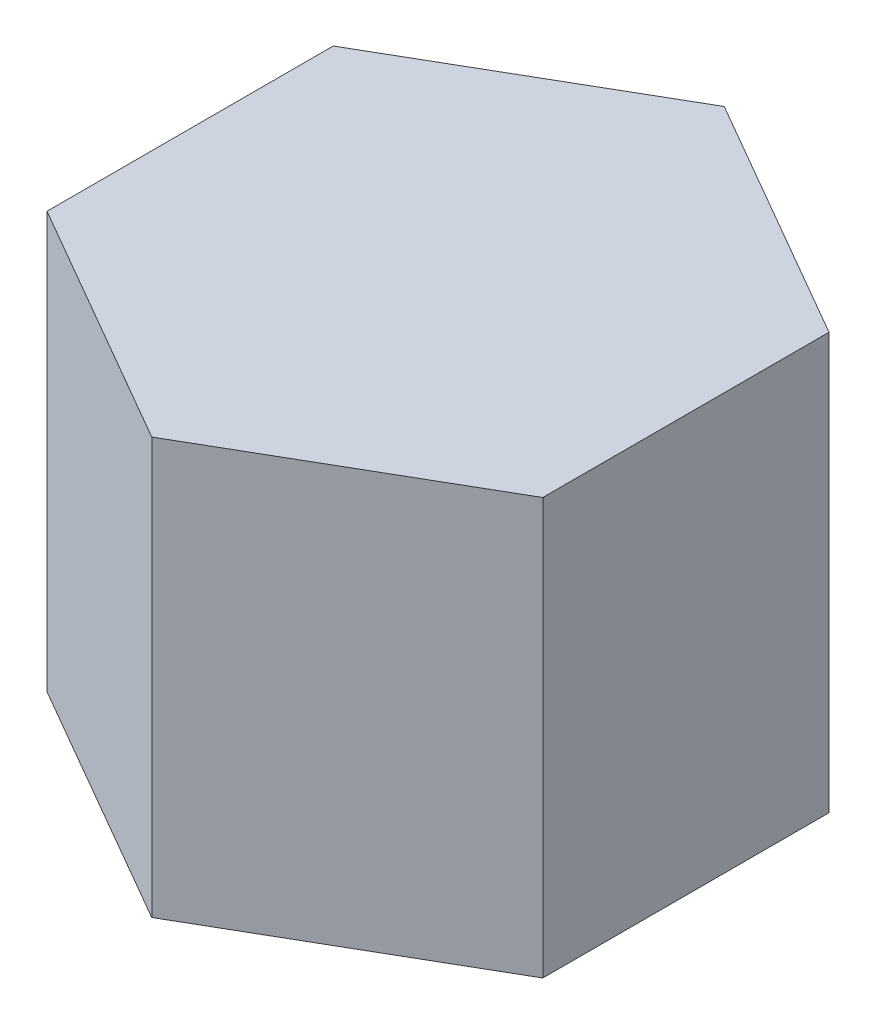
ISO-10303-21;
HEADER;
FILE_DESCRIPTION(('STEP AP214'),'2;1');
FILE_NAME('part.step','',(''),(''),'','','');
FILE_SCHEMA(('AUTOMOTIVE_DESIGN { 1 0 10303 214 1 1 1 1 }'));
ENDSEC;
DATA;
#1=APPLICATION_CONTEXT('core data for automotive mechanical design processes');
#2=APPLICATION_PROTOCOL_DEFINITION('international standard','automotive_design',2000,#1);
#3=PRODUCT_CONTEXT('',#1,'mechanical');
#4=PRODUCT('Part','Part','',(#3));
#5=PRODUCT_RELATED_PRODUCT_CATEGORY('part','',(#4));
#6=PRODUCT_DEFINITION_FORMATION('','',#4);
#7=PRODUCT_DEFINITION_CONTEXT('part definition',#1,'design');
#8=PRODUCT_DEFINITION('design','',#6,#7);
#9=PRODUCT_DEFINITION_SHAPE('','',#8);
#10=(LENGTH_UNIT() NAMED_UNIT(*) SI_UNIT(.MILLI.,.METRE.));
#11=(NAMED_UNIT(*) PLANE_ANGLE_UNIT() SI_UNIT($,.RADIAN.));
#12=(NAMED_UNIT(*) SI_UNIT($,.STERADIAN.) SOLID_ANGLE_UNIT());
#13=UNCERTAINTY_MEASURE_WITH_UNIT(LENGTH_MEASURE(1.E-05),#10,'distance_accuracy_value','');
#14=(GEOMETRIC_REPRESENTATION_CONTEXT(3) GLOBAL_UNCERTAINTY_ASSIGNED_CONTEXT((#13)) GLOBAL_UNIT_ASSIGNED_CONTEXT((#10,
#11,#12)) REPRESENTATION_CONTEXT('',''));
#15=CARTESIAN_POINT('',(0.,0.,0.));
#16=DIRECTION('',(0.,0.,1.));
#17=DIRECTION('',(1.,0.,0.));
#18=AXIS2_PLACEMENT_3D('',#15,#16,#17);
#19=CARTESIAN_POINT('',(201.839551417382,-147.556598747966,290.81594581671));
#20=DIRECTION('',(-0.500000000000096,0.,-0.866025403784383));
#21=DIRECTION('',(-0.866025403784383,0.,0.500000000000096));
#22=AXIS2_PLACEMENT_3D('',#19,#20,#21);
#23=PLANE('',#22);
#24=CARTESIAN_POINT('',(202.142660308706,-147.047793579175,290.64094581671));
#25=DIRECTION('',(-0.866025403784383,0.,0.500000000000096));
#26=VECTOR('',#25,1.);
#27=LINE('',#24,#26);
#28=CARTESIAN_POINT('',(202.142660308706,-147.047793579175,290.64094581671));
#29=VERTEX_POINT('',#28);
#30=CARTESIAN_POINT('',(201.839551417382,-147.047793579175,290.81594581671));
#31=VERTEX_POINT('',#30);
#32=EDGE_CURVE('E170',#29,#31,#27,.T.);
#33=ORIENTED_EDGE('',*,*,#32,.T.);
#34=CARTESIAN_POINT('',(201.839551417382,-147.556598747966,290.81594581671));
#35=DIRECTION('',(0.,1.,0.));
#36=VECTOR('',#35,1.);
#37=LINE('',#34,#36);
#38=CARTESIAN_POINT('',(201.839551417382,-147.556598747966,290.81594581671));
#39=VERTEX_POINT('',#38);
#40=EDGE_CURVE('E35',#39,#31,#37,.T.);
#41=ORIENTED_EDGE('',*,*,#40,.F.);
#42=CARTESIAN_POINT('',(202.142660308706,-147.556598747966,290.64094581671));
#43=DIRECTION('',(-0.866025403784383,0.,0.500000000000096));
#44=VECTOR('',#43,1.);
#45=LINE('',#42,#44);
#46=CARTESIAN_POINT('',(202.142660308706,-147.556598747966,290.64094581671));
#47=VERTEX_POINT('',#46);
#48=EDGE_CURVE('E159',#47,#39,#45,.T.);
#49=ORIENTED_EDGE('',*,*,#48,.F.);
#50=CARTESIAN_POINT('',(202.142660308706,-147.556598747966,290.64094581671));
#51=DIRECTION('',(0.,1.,0.));
#52=VECTOR('',#51,1.);
#53=LINE('',#50,#52);
#54=EDGE_CURVE('E10',#47,#29,#53,.T.);
#55=ORIENTED_EDGE('',*,*,#54,.T.);
#56=EDGE_LOOP('',(#33,#41,#49,#55));
#57=FACE_BOUND('',#56,.T.);
#58=ADVANCED_FACE('F16',(#57),#23,.F.);
#59=CARTESIAN_POINT('',(202.142660308706,-147.556598747966,291.594471220494));
#60=DIRECTION('',(-1.,0.,0.));
#61=DIRECTION('',(0.,-1.,0.));
#62=AXIS2_PLACEMENT_3D('',#59,#60,#61);
#63=PLANE('',#62);
#64=CARTESIAN_POINT('',(202.142660308706,-147.047793579175,290.29094581671));
#65=DIRECTION('',(0.,0.,1.));
#66=VECTOR('',#65,1.);
#67=LINE('',#64,#66);
#68=CARTESIAN_POINT('',(202.142660308706,-147.047793579175,290.29094581671));
#69=VERTEX_POINT('',#68);
#70=EDGE_CURVE('E167',#69,#29,#67,.T.);
#71=ORIENTED_EDGE('',*,*,#70,.T.);
#72=ORIENTED_EDGE('',*,*,#54,.F.);
#73=CARTESIAN_POINT('',(202.142660308706,-147.556598747966,290.29094581671));
#74=DIRECTION('',(0.,0.,1.));
#75=VECTOR('',#74,1.);
#76=LINE('',#73,#75);
#77=CARTESIAN_POINT('',(202.142660308706,-147.556598747966,290.29094581671));
#78=VERTEX_POINT('',#77);
#79=EDGE_CURVE('E156',#78,#47,#76,.T.);
#80=ORIENTED_EDGE('',*,*,#79,.F.);
#81=CARTESIAN_POINT('',(202.142660308706,-147.556598747966,290.29094581671));
#82=DIRECTION('',(0.,1.,0.));
#83=VECTOR('',#82,1.);
#84=LINE('',#81,#83);
#85=EDGE_CURVE('E27',#78,#69,#84,.T.);
#86=ORIENTED_EDGE('',*,*,#85,.T.);
#87=EDGE_LOOP('',(#71,#72,#80,#86));
#88=FACE_BOUND('',#87,.T.);
#89=ADVANCED_FACE('F189',(#88),#63,.F.);
#90=CARTESIAN_POINT('',(202.142660308706,-147.556598747966,290.29094581671));
#91=DIRECTION('',(-0.499999999999909,0.,0.866025403784491));
#92=DIRECTION('',(0.866025403784491,0.,0.499999999999909));
#93=AXIS2_PLACEMENT_3D('',#90,#91,#92);
#94=PLANE('',#93);
#95=CARTESIAN_POINT('',(201.839551417381,-147.047793579175,290.11594581671));
#96=DIRECTION('',(0.866025403784491,0.,0.499999999999909));
#97=VECTOR('',#96,1.);
#98=LINE('',#95,#97);
#99=CARTESIAN_POINT('',(201.839551417382,-147.047793579175,290.11594581671));
#100=VERTEX_POINT('',#99);
#101=EDGE_CURVE('E163',#100,#69,#98,.T.);
#102=ORIENTED_EDGE('',*,*,#101,.T.);
#103=ORIENTED_EDGE('',*,*,#85,.F.);
#104=CARTESIAN_POINT('',(201.839551417381,-147.556598747966,290.11594581671));
#105=DIRECTION('',(0.866025403784491,0.,0.499999999999909));
#106=VECTOR('',#105,1.);
#107=LINE('',#104,#106);
#108=CARTESIAN_POINT('',(201.839551417382,-147.556598747966,290.11594581671));
#109=VERTEX_POINT('',#108);
#110=EDGE_CURVE('E106',#109,#78,#107,.T.);
#111=ORIENTED_EDGE('',*,*,#110,.F.);
#112=CARTESIAN_POINT('',(201.839551417381,-147.556598747966,290.11594581671));
#113=DIRECTION('',(0.,1.,0.));
#114=VECTOR('',#113,1.);
#115=LINE('',#112,#114);
#116=EDGE_CURVE('E94',#109,#100,#115,.T.);
#117=ORIENTED_EDGE('',*,*,#116,.T.);
#118=EDGE_LOOP('',(#102,#103,#111,#117));
#119=FACE_BOUND('',#118,.T.);
#120=ADVANCED_FACE('F198',(#119),#94,.F.);
#121=CARTESIAN_POINT('',(201.839551417382,-147.556598747966,290.11594581671));
#122=DIRECTION('',(0.500000000000096,0.,0.866025403784383));
#123=DIRECTION('',(0.866025403784383,0.,-0.500000000000096));
#124=AXIS2_PLACEMENT_3D('',#121,#122,#123);
#125=PLANE('',#124);
#126=CARTESIAN_POINT('',(201.536442526057,-147.047793579175,290.29094581671));
#127=DIRECTION('',(0.866025403784383,0.,-0.500000000000096));
#128=VECTOR('',#127,1.);
#129=LINE('',#126,#128);
#130=CARTESIAN_POINT('',(201.536442526057,-147.047793579175,290.29094581671));
#131=VERTEX_POINT('',#130);
#132=EDGE_CURVE('E162',#131,#100,#129,.T.);
#133=ORIENTED_EDGE('',*,*,#132,.T.);
#134=ORIENTED_EDGE('',*,*,#116,.F.);
#135=CARTESIAN_POINT('',(201.536442526057,-147.556598747966,290.29094581671));
#136=DIRECTION('',(0.866025403784383,0.,-0.500000000000096));
#137=VECTOR('',#136,1.);
#138=LINE('',#135,#137);
#139=CARTESIAN_POINT('',(201.536442526057,-147.556598747966,290.29094581671));
#140=VERTEX_POINT('',#139);
#141=EDGE_CURVE('E98',#140,#109,#138,.T.);
#142=ORIENTED_EDGE('',*,*,#141,.F.);
#143=CARTESIAN_POINT('',(201.536442526057,-147.556598747966,290.29094581671));
#144=DIRECTION('',(0.,1.,0.));
#145=VECTOR('',#144,1.);
#146=LINE('',#143,#145);
#147=EDGE_CURVE('E79',#140,#131,#146,.T.);
#148=ORIENTED_EDGE('',*,*,#147,.T.);
#149=EDGE_LOOP('',(#133,#134,#142,#148));
#150=FACE_BOUND('',#149,.T.);
#151=ADVANCED_FACE('F100',(#150),#125,.F.);
#152=CARTESIAN_POINT('',(201.536442526057,-147.556598747966,291.594471220494));
#153=DIRECTION('',(1.,0.,0.));
#154=DIRECTION('',(0.,1.,0.));
#155=AXIS2_PLACEMENT_3D('',#152,#153,#154);
#156=PLANE('',#155);
#157=CARTESIAN_POINT('',(201.536442526057,-147.047793579175,290.64094581671));
#158=DIRECTION('',(0.,0.,-1.));
#159=VECTOR('',#158,1.);
#160=LINE('',#157,#159);
#161=CARTESIAN_POINT('',(201.536442526057,-147.047793579175,290.64094581671));
#162=VERTEX_POINT('',#161);
#163=EDGE_CURVE('E88',#162,#131,#160,.T.);
#164=ORIENTED_EDGE('',*,*,#163,.T.);
#165=ORIENTED_EDGE('',*,*,#147,.F.);
#166=CARTESIAN_POINT('',(201.536442526057,-147.556598747966,290.64094581671));
#167=DIRECTION('',(0.,0.,-1.));
#168=VECTOR('',#167,1.);
#169=LINE('',#166,#168);
#170=CARTESIAN_POINT('',(201.536442526057,-147.556598747966,290.64094581671));
#171=VERTEX_POINT('',#170);
#172=EDGE_CURVE('E84',#171,#140,#169,.T.);
#173=ORIENTED_EDGE('',*,*,#172,.F.);
#174=CARTESIAN_POINT('',(201.536442526057,-147.556598747966,290.64094581671));
#175=DIRECTION('',(0.,1.,0.));
#176=VECTOR('',#175,1.);
#177=LINE('',#174,#176);
#178=EDGE_CURVE('E58',#171,#162,#177,.T.);
#179=ORIENTED_EDGE('',*,*,#178,.T.);
#180=EDGE_LOOP('',(#164,#165,#173,#179));
#181=FACE_BOUND('',#180,.T.);
#182=ADVANCED_FACE('F82',(#181),#156,.F.);
#183=CARTESIAN_POINT('',(201.536442526057,-147.556598747966,290.64094581671));
#184=DIRECTION('',(0.499999999999978,0.,-0.866025403784452));
#185=DIRECTION('',(-0.866025403784452,0.,-0.499999999999978));
#186=AXIS2_PLACEMENT_3D('',#183,#184,#185);
#187=PLANE('',#186);
#188=CARTESIAN_POINT('',(201.839551417382,-147.047793579175,290.81594581671));
#189=DIRECTION('',(-0.866025403784452,0.,-0.499999999999978));
#190=VECTOR('',#189,1.);
#191=LINE('',#188,#190);
#192=EDGE_CURVE('E160',#31,#162,#191,.T.);
#193=ORIENTED_EDGE('',*,*,#192,.T.);
#194=ORIENTED_EDGE('',*,*,#178,.F.);
#195=CARTESIAN_POINT('',(201.839551417382,-147.556598747966,290.81594581671));
#196=DIRECTION('',(-0.866025403784452,0.,-0.499999999999978));
#197=VECTOR('',#196,1.);
#198=LINE('',#195,#197);
#199=EDGE_CURVE('E112',#39,#171,#198,.T.);
#200=ORIENTED_EDGE('',*,*,#199,.F.);
#201=ORIENTED_EDGE('',*,*,#40,.T.);
#202=EDGE_LOOP('',(#193,#194,#200,#201));
#203=FACE_BOUND('',#202,.T.);
#204=ADVANCED_FACE('F131',(#203),#187,.F.);
#205=CARTESIAN_POINT('',(206.491105863044,-147.556598747966,291.594471220494));
#206=DIRECTION('',(0.,1.,0.));
#207=DIRECTION('',(-1.,0.,0.));
#208=AXIS2_PLACEMENT_3D('',#205,#206,#207);
#209=PLANE('',#208);
#210=ORIENTED_EDGE('',*,*,#48,.T.);
#211=ORIENTED_EDGE('',*,*,#199,.T.);
#212=ORIENTED_EDGE('',*,*,#172,.T.);
#213=ORIENTED_EDGE('',*,*,#141,.T.);
#214=ORIENTED_EDGE('',*,*,#110,.T.);
#215=ORIENTED_EDGE('',*,*,#79,.T.);
#216=EDGE_LOOP('',(#210,#211,#212,#213,#214,#215));
#217=FACE_BOUND('',#216,.T.);
#218=ADVANCED_FACE('F111',(#217),#209,.F.);
#219=CARTESIAN_POINT('',(206.491105863044,-147.047793579175,291.594471220494));
#220=DIRECTION('',(0.,1.,0.));
#221=DIRECTION('',(-1.,0.,0.));
#222=AXIS2_PLACEMENT_3D('',#219,#220,#221);
#223=PLANE('',#222);
#224=ORIENTED_EDGE('',*,*,#32,.F.);
#225=ORIENTED_EDGE('',*,*,#70,.F.);
#226=ORIENTED_EDGE('',*,*,#101,.F.);
#227=ORIENTED_EDGE('',*,*,#132,.F.);
#228=ORIENTED_EDGE('',*,*,#163,.F.);
#229=ORIENTED_EDGE('',*,*,#192,.F.);
#230=EDGE_LOOP('',(#224,#225,#226,#227,#228,#229));
#231=FACE_BOUND('',#230,.T.);
#232=ADVANCED_FACE('F130',(#231),#223,.T.);
#233=CLOSED_SHELL('',(#58,#89,#120,#151,#182,#204,#218,#232));
#234=MANIFOLD_SOLID_BREP('B1',#233);
#235=ADVANCED_BREP_SHAPE_REPRESENTATION('',(#18,#234),#14);
#236=SHAPE_DEFINITION_REPRESENTATION(#9,#235);
ENDSEC;
END-ISO-10303-21;
